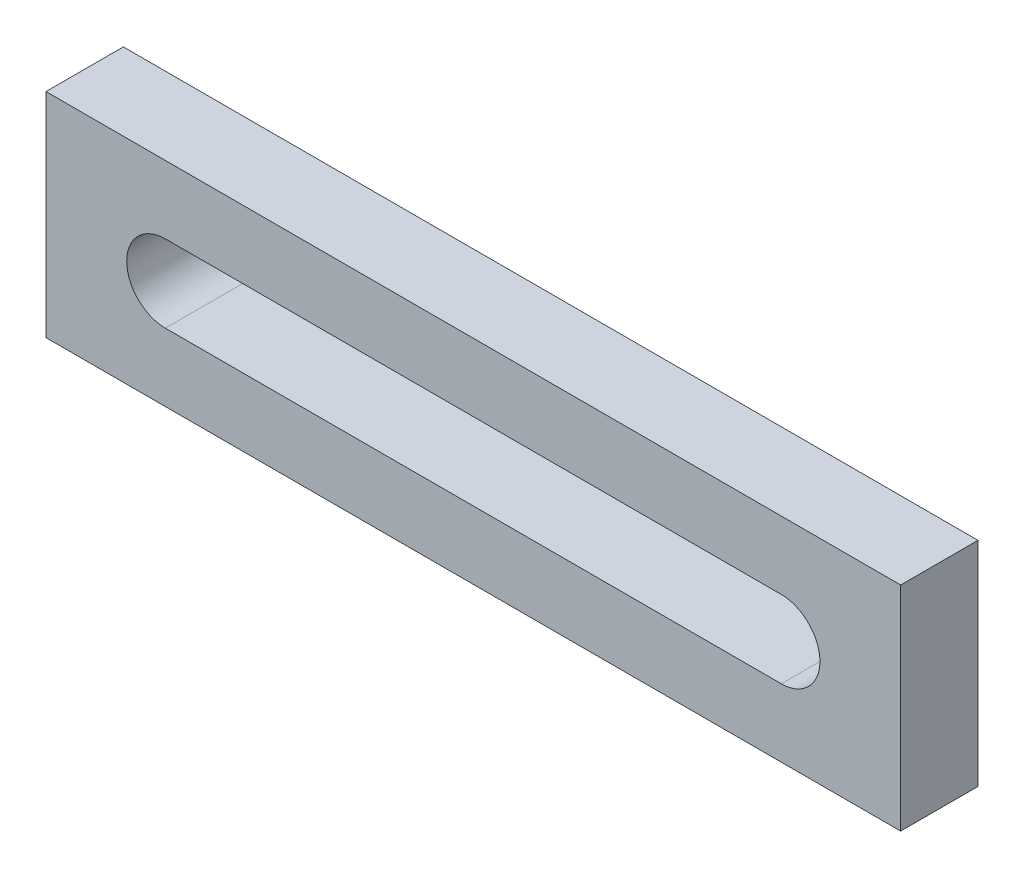
ISO-10303-21;
HEADER;
FILE_DESCRIPTION(('STEP AP214'),'2;1');
FILE_NAME('part.step','',(''),(''),'','','');
FILE_SCHEMA(('AUTOMOTIVE_DESIGN { 1 0 10303 214 1 1 1 1 }'));
ENDSEC;
DATA;
#1=APPLICATION_CONTEXT('core data for automotive mechanical design processes');
#2=APPLICATION_PROTOCOL_DEFINITION('international standard','automotive_design',2000,#1);
#3=PRODUCT_CONTEXT('',#1,'mechanical');
#4=PRODUCT('Part','Part','',(#3));
#5=PRODUCT_RELATED_PRODUCT_CATEGORY('part','',(#4));
#6=PRODUCT_DEFINITION_FORMATION('','',#4);
#7=PRODUCT_DEFINITION_CONTEXT('part definition',#1,'design');
#8=PRODUCT_DEFINITION('design','',#6,#7);
#9=PRODUCT_DEFINITION_SHAPE('','',#8);
#10=(LENGTH_UNIT() NAMED_UNIT(*) SI_UNIT(.MILLI.,.METRE.));
#11=(NAMED_UNIT(*) PLANE_ANGLE_UNIT() SI_UNIT($,.RADIAN.));
#12=(NAMED_UNIT(*) SI_UNIT($,.STERADIAN.) SOLID_ANGLE_UNIT());
#13=UNCERTAINTY_MEASURE_WITH_UNIT(LENGTH_MEASURE(1.E-05),#10,'distance_accuracy_value','');
#14=(GEOMETRIC_REPRESENTATION_CONTEXT(3) GLOBAL_UNCERTAINTY_ASSIGNED_CONTEXT((#13)) GLOBAL_UNIT_ASSIGNED_CONTEXT((#10,
#11,#12)) REPRESENTATION_CONTEXT('',''));
#15=CARTESIAN_POINT('',(0.,0.,0.));
#16=DIRECTION('',(0.,0.,1.));
#17=DIRECTION('',(1.,0.,0.));
#18=AXIS2_PLACEMENT_3D('',#15,#16,#17);
#19=CARTESIAN_POINT('',(0.,0.,10.));
#20=DIRECTION('',(0.,0.,-1.));
#21=DIRECTION('',(-1.,0.,0.));
#22=AXIS2_PLACEMENT_3D('',#19,#20,#21);
#23=PLANE('',#22);
#24=DIRECTION('',(0.,-1.,0.));
#25=VECTOR('',#24,1.);
#26=CARTESIAN_POINT('',(0.,0.,10.));
#27=LINE('',#26,#25);
#28=CARTESIAN_POINT('',(0.,27.561003640279,10.));
#29=VERTEX_POINT('',#28);
#30=CARTESIAN_POINT('',(0.,0.,10.));
#31=VERTEX_POINT('',#30);
#32=EDGE_CURVE('E136',#29,#31,#27,.T.);
#33=ORIENTED_EDGE('',*,*,#32,.T.);
#34=DIRECTION('',(1.,0.,0.));
#35=VECTOR('',#34,1.);
#36=CARTESIAN_POINT('',(0.,0.,10.));
#37=LINE('',#36,#35);
#38=CARTESIAN_POINT('',(110.510118672223,0.,10.));
#39=VERTEX_POINT('',#38);
#40=EDGE_CURVE('E139',#31,#39,#37,.T.);
#41=ORIENTED_EDGE('',*,*,#40,.T.);
#42=DIRECTION('',(0.,1.,0.));
#43=VECTOR('',#42,1.);
#44=CARTESIAN_POINT('',(110.510118672223,0.,10.));
#45=LINE('',#44,#43);
#46=CARTESIAN_POINT('',(110.510118672223,27.561003640279,10.));
#47=VERTEX_POINT('',#46);
#48=EDGE_CURVE('E142',#39,#47,#45,.T.);
#49=ORIENTED_EDGE('',*,*,#48,.T.);
#50=DIRECTION('',(-1.,0.,0.));
#51=VECTOR('',#50,1.);
#52=CARTESIAN_POINT('',(0.,27.561003640279,10.));
#53=LINE('',#52,#51);
#54=EDGE_CURVE('E144',#47,#29,#53,.T.);
#55=ORIENTED_EDGE('',*,*,#54,.T.);
#56=EDGE_LOOP('',(#33,#41,#49,#55));
#57=FACE_BOUND('',#56,.T.);
#58=CARTESIAN_POINT('',(15.435752348122,13.7805018201395,10.));
#59=DIRECTION('',(0.,0.,1.));
#60=DIRECTION('',(1.,0.,0.));
#61=AXIS2_PLACEMENT_3D('',#58,#59,#60);
#62=CIRCLE('',#61,5.00000000000001);
#63=CARTESIAN_POINT('',(15.435752348122,18.7805018201396,10.));
#64=VERTEX_POINT('',#63);
#65=CARTESIAN_POINT('',(15.435752348122,8.78050182013954,10.));
#66=VERTEX_POINT('',#65);
#67=EDGE_CURVE('E100',#64,#66,#62,.T.);
#68=ORIENTED_EDGE('',*,*,#67,.F.);
#69=DIRECTION('',(-1.,0.,0.));
#70=VECTOR('',#69,1.);
#71=CARTESIAN_POINT('',(15.435752348122,18.7805018201396,10.));
#72=LINE('',#71,#70);
#73=CARTESIAN_POINT('',(95.0743663241008,18.7805018201396,10.));
#74=VERTEX_POINT('',#73);
#75=EDGE_CURVE('E122',#74,#64,#72,.T.);
#76=ORIENTED_EDGE('',*,*,#75,.F.);
#77=CARTESIAN_POINT('',(95.0743663241008,13.7805018201395,10.));
#78=DIRECTION('',(0.,0.,1.));
#79=DIRECTION('',(1.,0.,0.));
#80=AXIS2_PLACEMENT_3D('',#77,#78,#79);
#81=CIRCLE('',#80,5.00000000000001);
#82=CARTESIAN_POINT('',(95.0743663241008,8.78050182013954,10.));
#83=VERTEX_POINT('',#82);
#84=EDGE_CURVE('E120',#83,#74,#81,.T.);
#85=ORIENTED_EDGE('',*,*,#84,.F.);
#86=DIRECTION('',(1.,0.,0.));
#87=VECTOR('',#86,1.);
#88=CARTESIAN_POINT('',(15.435752348122,8.78050182013954,10.));
#89=LINE('',#88,#87);
#90=EDGE_CURVE('E108',#66,#83,#89,.T.);
#91=ORIENTED_EDGE('',*,*,#90,.F.);
#92=EDGE_LOOP('',(#68,#76,#85,#91));
#93=FACE_BOUND('',#92,.T.);
#94=ADVANCED_FACE('F35',(#57,#93),#23,.F.);
#95=CARTESIAN_POINT('',(0.,0.,0.));
#96=DIRECTION('',(0.,0.,-1.));
#97=DIRECTION('',(-1.,0.,0.));
#98=AXIS2_PLACEMENT_3D('',#95,#96,#97);
#99=PLANE('',#98);
#100=DIRECTION('',(0.,-1.,0.));
#101=VECTOR('',#100,1.);
#102=CARTESIAN_POINT('',(0.,0.,0.));
#103=LINE('',#102,#101);
#104=CARTESIAN_POINT('',(0.,27.561003640279,0.));
#105=VERTEX_POINT('',#104);
#106=CARTESIAN_POINT('',(0.,0.,0.));
#107=VERTEX_POINT('',#106);
#108=EDGE_CURVE('E116',#105,#107,#103,.T.);
#109=ORIENTED_EDGE('',*,*,#108,.F.);
#110=DIRECTION('',(-1.,0.,0.));
#111=VECTOR('',#110,1.);
#112=CARTESIAN_POINT('',(0.,27.561003640279,0.));
#113=LINE('',#112,#111);
#114=CARTESIAN_POINT('',(110.510118672223,27.561003640279,0.));
#115=VERTEX_POINT('',#114);
#116=EDGE_CURVE('E140',#115,#105,#113,.T.);
#117=ORIENTED_EDGE('',*,*,#116,.F.);
#118=DIRECTION('',(0.,1.,0.));
#119=VECTOR('',#118,1.);
#120=CARTESIAN_POINT('',(110.510118672223,0.,0.));
#121=LINE('',#120,#119);
#122=CARTESIAN_POINT('',(110.510118672223,0.,0.));
#123=VERTEX_POINT('',#122);
#124=EDGE_CURVE('E151',#123,#115,#121,.T.);
#125=ORIENTED_EDGE('',*,*,#124,.F.);
#126=DIRECTION('',(1.,0.,0.));
#127=VECTOR('',#126,1.);
#128=CARTESIAN_POINT('',(0.,0.,0.));
#129=LINE('',#128,#127);
#130=EDGE_CURVE('E149',#107,#123,#129,.T.);
#131=ORIENTED_EDGE('',*,*,#130,.F.);
#132=EDGE_LOOP('',(#109,#117,#125,#131));
#133=FACE_BOUND('',#132,.T.);
#134=DIRECTION('',(-1.,0.,0.));
#135=VECTOR('',#134,1.);
#136=CARTESIAN_POINT('',(15.435752348122,18.7805018201396,0.));
#137=LINE('',#136,#135);
#138=CARTESIAN_POINT('',(95.0743663241008,18.7805018201396,0.));
#139=VERTEX_POINT('',#138);
#140=CARTESIAN_POINT('',(15.435752348122,18.7805018201396,0.));
#141=VERTEX_POINT('',#140);
#142=EDGE_CURVE('E109',#139,#141,#137,.T.);
#143=ORIENTED_EDGE('',*,*,#142,.T.);
#144=CARTESIAN_POINT('',(15.435752348122,13.7805018201395,0.));
#145=DIRECTION('',(0.,0.,1.));
#146=DIRECTION('',(1.,0.,0.));
#147=AXIS2_PLACEMENT_3D('',#144,#145,#146);
#148=CIRCLE('',#147,5.00000000000001);
#149=CARTESIAN_POINT('',(15.435752348122,8.78050182013954,0.));
#150=VERTEX_POINT('',#149);
#151=EDGE_CURVE('E58',#141,#150,#148,.T.);
#152=ORIENTED_EDGE('',*,*,#151,.T.);
#153=DIRECTION('',(1.,0.,0.));
#154=VECTOR('',#153,1.);
#155=CARTESIAN_POINT('',(15.435752348122,8.78050182013954,0.));
#156=LINE('',#155,#154);
#157=CARTESIAN_POINT('',(95.0743663241008,8.78050182013954,0.));
#158=VERTEX_POINT('',#157);
#159=EDGE_CURVE('E115',#150,#158,#156,.T.);
#160=ORIENTED_EDGE('',*,*,#159,.T.);
#161=CARTESIAN_POINT('',(95.0743663241008,13.7805018201395,0.));
#162=DIRECTION('',(0.,0.,1.));
#163=DIRECTION('',(1.,0.,0.));
#164=AXIS2_PLACEMENT_3D('',#161,#162,#163);
#165=CIRCLE('',#164,5.00000000000001);
#166=EDGE_CURVE('E128',#158,#139,#165,.T.);
#167=ORIENTED_EDGE('',*,*,#166,.T.);
#168=EDGE_LOOP('',(#143,#152,#160,#167));
#169=FACE_BOUND('',#168,.T.);
#170=ADVANCED_FACE('F169',(#133,#169),#99,.T.);
#171=CARTESIAN_POINT('',(0.,0.,10.));
#172=DIRECTION('',(1.,0.,0.));
#173=DIRECTION('',(0.,0.,-1.));
#174=AXIS2_PLACEMENT_3D('',#171,#172,#173);
#175=PLANE('',#174);
#176=ORIENTED_EDGE('',*,*,#108,.T.);
#177=DIRECTION('',(0.,0.,-1.));
#178=VECTOR('',#177,1.);
#179=CARTESIAN_POINT('',(0.,0.,10.));
#180=LINE('',#179,#178);
#181=EDGE_CURVE('E11',#31,#107,#180,.T.);
#182=ORIENTED_EDGE('',*,*,#181,.F.);
#183=ORIENTED_EDGE('',*,*,#32,.F.);
#184=DIRECTION('',(0.,0.,-1.));
#185=VECTOR('',#184,1.);
#186=CARTESIAN_POINT('',(0.,27.561003640279,10.));
#187=LINE('',#186,#185);
#188=EDGE_CURVE('E146',#29,#105,#187,.T.);
#189=ORIENTED_EDGE('',*,*,#188,.T.);
#190=EDGE_LOOP('',(#176,#182,#183,#189));
#191=FACE_BOUND('',#190,.T.);
#192=ADVANCED_FACE('F37',(#191),#175,.F.);
#193=CARTESIAN_POINT('',(0.,0.,10.));
#194=DIRECTION('',(0.,1.,0.));
#195=DIRECTION('',(-1.,0.,0.));
#196=AXIS2_PLACEMENT_3D('',#193,#194,#195);
#197=PLANE('',#196);
#198=ORIENTED_EDGE('',*,*,#130,.T.);
#199=DIRECTION('',(0.,0.,-1.));
#200=VECTOR('',#199,1.);
#201=CARTESIAN_POINT('',(110.510118672223,0.,10.));
#202=LINE('',#201,#200);
#203=EDGE_CURVE('E43',#39,#123,#202,.T.);
#204=ORIENTED_EDGE('',*,*,#203,.F.);
#205=ORIENTED_EDGE('',*,*,#40,.F.);
#206=ORIENTED_EDGE('',*,*,#181,.T.);
#207=EDGE_LOOP('',(#198,#204,#205,#206));
#208=FACE_BOUND('',#207,.T.);
#209=ADVANCED_FACE('F179',(#208),#197,.F.);
#210=CARTESIAN_POINT('',(110.510118672223,0.,10.));
#211=DIRECTION('',(-1.,0.,0.));
#212=DIRECTION('',(0.,0.,1.));
#213=AXIS2_PLACEMENT_3D('',#210,#211,#212);
#214=PLANE('',#213);
#215=ORIENTED_EDGE('',*,*,#124,.T.);
#216=DIRECTION('',(0.,0.,-1.));
#217=VECTOR('',#216,1.);
#218=CARTESIAN_POINT('',(110.510118672223,27.561003640279,10.));
#219=LINE('',#218,#217);
#220=EDGE_CURVE('E156',#47,#115,#219,.T.);
#221=ORIENTED_EDGE('',*,*,#220,.F.);
#222=ORIENTED_EDGE('',*,*,#48,.F.);
#223=ORIENTED_EDGE('',*,*,#203,.T.);
#224=EDGE_LOOP('',(#215,#221,#222,#223));
#225=FACE_BOUND('',#224,.T.);
#226=ADVANCED_FACE('F163',(#225),#214,.F.);
#227=CARTESIAN_POINT('',(0.,27.561003640279,10.));
#228=DIRECTION('',(0.,-1.,0.));
#229=DIRECTION('',(1.,0.,0.));
#230=AXIS2_PLACEMENT_3D('',#227,#228,#229);
#231=PLANE('',#230);
#232=ORIENTED_EDGE('',*,*,#116,.T.);
#233=ORIENTED_EDGE('',*,*,#188,.F.);
#234=ORIENTED_EDGE('',*,*,#54,.F.);
#235=ORIENTED_EDGE('',*,*,#220,.T.);
#236=EDGE_LOOP('',(#232,#233,#234,#235));
#237=FACE_BOUND('',#236,.T.);
#238=ADVANCED_FACE('F173',(#237),#231,.F.);
#239=CARTESIAN_POINT('',(15.435752348122,13.7805018201395,10.));
#240=DIRECTION('',(0.,0.,-1.));
#241=DIRECTION('',(-1.,0.,0.));
#242=AXIS2_PLACEMENT_3D('',#239,#240,#241);
#243=CYLINDRICAL_SURFACE('',#242,5.00000000000001);
#244=ORIENTED_EDGE('',*,*,#151,.F.);
#245=DIRECTION('',(0.,0.,-1.));
#246=VECTOR('',#245,1.);
#247=CARTESIAN_POINT('',(15.435752348122,18.7805018201396,10.));
#248=LINE('',#247,#246);
#249=EDGE_CURVE('E104',#64,#141,#248,.T.);
#250=ORIENTED_EDGE('',*,*,#249,.F.);
#251=ORIENTED_EDGE('',*,*,#67,.T.);
#252=DIRECTION('',(0.,0.,-1.));
#253=VECTOR('',#252,1.);
#254=CARTESIAN_POINT('',(15.435752348122,8.78050182013954,10.));
#255=LINE('',#254,#253);
#256=EDGE_CURVE('E103',#66,#150,#255,.T.);
#257=ORIENTED_EDGE('',*,*,#256,.T.);
#258=EDGE_LOOP('',(#244,#250,#251,#257));
#259=FACE_BOUND('',#258,.T.);
#260=ADVANCED_FACE('F102',(#259),#243,.F.);
#261=CARTESIAN_POINT('',(15.435752348122,8.78050182013954,10.));
#262=DIRECTION('',(0.,1.,0.));
#263=DIRECTION('',(-1.,0.,0.));
#264=AXIS2_PLACEMENT_3D('',#261,#262,#263);
#265=PLANE('',#264);
#266=ORIENTED_EDGE('',*,*,#159,.F.);
#267=ORIENTED_EDGE('',*,*,#256,.F.);
#268=ORIENTED_EDGE('',*,*,#90,.T.);
#269=DIRECTION('',(0.,0.,-1.));
#270=VECTOR('',#269,1.);
#271=CARTESIAN_POINT('',(95.0743663241008,8.78050182013954,10.));
#272=LINE('',#271,#270);
#273=EDGE_CURVE('E117',#83,#158,#272,.T.);
#274=ORIENTED_EDGE('',*,*,#273,.T.);
#275=EDGE_LOOP('',(#266,#267,#268,#274));
#276=FACE_BOUND('',#275,.T.);
#277=ADVANCED_FACE('F112',(#276),#265,.T.);
#278=CARTESIAN_POINT('',(95.0743663241008,13.7805018201395,10.));
#279=DIRECTION('',(0.,0.,-1.));
#280=DIRECTION('',(-1.,0.,0.));
#281=AXIS2_PLACEMENT_3D('',#278,#279,#280);
#282=CYLINDRICAL_SURFACE('',#281,5.00000000000001);
#283=ORIENTED_EDGE('',*,*,#166,.F.);
#284=ORIENTED_EDGE('',*,*,#273,.F.);
#285=ORIENTED_EDGE('',*,*,#84,.T.);
#286=DIRECTION('',(0.,0.,-1.));
#287=VECTOR('',#286,1.);
#288=CARTESIAN_POINT('',(95.0743663241008,18.7805018201396,10.));
#289=LINE('',#288,#287);
#290=EDGE_CURVE('E50',#74,#139,#289,.T.);
#291=ORIENTED_EDGE('',*,*,#290,.T.);
#292=EDGE_LOOP('',(#283,#284,#285,#291));
#293=FACE_BOUND('',#292,.T.);
#294=ADVANCED_FACE('F202',(#293),#282,.F.);
#295=CARTESIAN_POINT('',(15.435752348122,18.7805018201396,10.));
#296=DIRECTION('',(0.,-1.,0.));
#297=DIRECTION('',(1.,0.,0.));
#298=AXIS2_PLACEMENT_3D('',#295,#296,#297);
#299=PLANE('',#298);
#300=ORIENTED_EDGE('',*,*,#142,.F.);
#301=ORIENTED_EDGE('',*,*,#290,.F.);
#302=ORIENTED_EDGE('',*,*,#75,.T.);
#303=ORIENTED_EDGE('',*,*,#249,.T.);
#304=EDGE_LOOP('',(#300,#301,#302,#303));
#305=FACE_BOUND('',#304,.T.);
#306=ADVANCED_FACE('F206',(#305),#299,.T.);
#307=CLOSED_SHELL('',(#94,#170,#192,#209,#226,#238,#260,#277,#294,#306));
#308=MANIFOLD_SOLID_BREP('B2',#307);
#309=ADVANCED_BREP_SHAPE_REPRESENTATION('',(#18,#308),#14);
#310=SHAPE_DEFINITION_REPRESENTATION(#9,#309);
ENDSEC;
END-ISO-10303-21;
